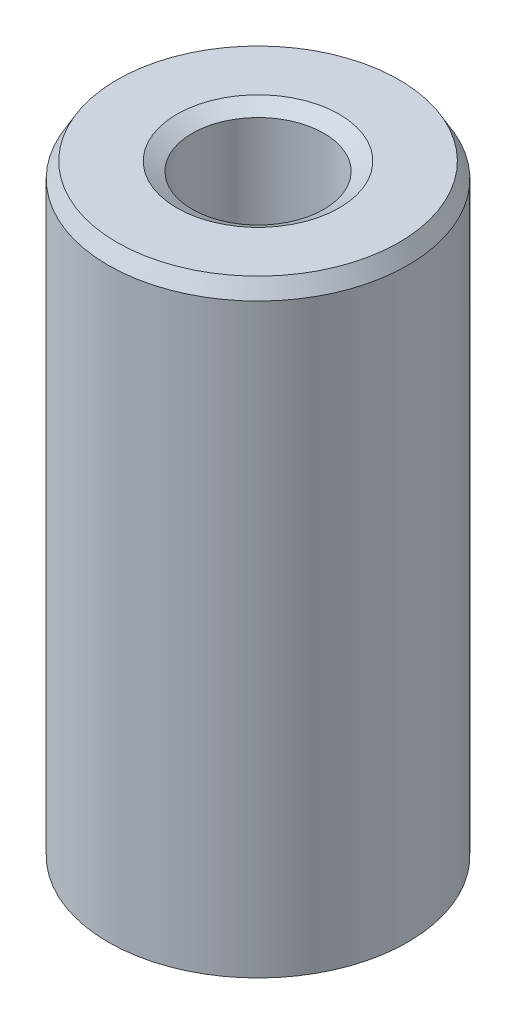
ISO-10303-21;
HEADER;
FILE_DESCRIPTION(('STEP AP214'),'2;1');
FILE_NAME('part.step','',(''),(''),'','','');
FILE_SCHEMA(('AUTOMOTIVE_DESIGN { 1 0 10303 214 1 1 1 1 }'));
ENDSEC;
DATA;
#1=APPLICATION_CONTEXT('core data for automotive mechanical design processes');
#2=APPLICATION_PROTOCOL_DEFINITION('international standard','automotive_design',2000,#1);
#3=PRODUCT_CONTEXT('',#1,'mechanical');
#4=PRODUCT('Part','Part','',(#3));
#5=PRODUCT_RELATED_PRODUCT_CATEGORY('part','',(#4));
#6=PRODUCT_DEFINITION_FORMATION('','',#4);
#7=PRODUCT_DEFINITION_CONTEXT('part definition',#1,'design');
#8=PRODUCT_DEFINITION('design','',#6,#7);
#9=PRODUCT_DEFINITION_SHAPE('','',#8);
#10=(LENGTH_UNIT() NAMED_UNIT(*) SI_UNIT(.MILLI.,.METRE.));
#11=(NAMED_UNIT(*) PLANE_ANGLE_UNIT() SI_UNIT($,.RADIAN.));
#12=(NAMED_UNIT(*) SI_UNIT($,.STERADIAN.) SOLID_ANGLE_UNIT());
#13=UNCERTAINTY_MEASURE_WITH_UNIT(LENGTH_MEASURE(1.E-05),#10,'distance_accuracy_value','');
#14=(GEOMETRIC_REPRESENTATION_CONTEXT(3) GLOBAL_UNCERTAINTY_ASSIGNED_CONTEXT((#13)) GLOBAL_UNIT_ASSIGNED_CONTEXT((#10,
#11,#12)) REPRESENTATION_CONTEXT('',''));
#15=CARTESIAN_POINT('',(0.,0.,0.));
#16=DIRECTION('',(0.,0.,1.));
#17=DIRECTION('',(1.,0.,0.));
#18=AXIS2_PLACEMENT_3D('',#15,#16,#17);
#19=CARTESIAN_POINT('',(0.,71.3074367263374,0.));
#20=DIRECTION('',(0.,-1.,0.));
#21=DIRECTION('',(0.,0.,-1.));
#22=AXIS2_PLACEMENT_3D('',#19,#20,#21);
#23=CYLINDRICAL_SURFACE('',#22,17.5);
#24=CARTESIAN_POINT('',(0.,1.03408028774482,0.));
#25=DIRECTION('',(0.,1.,0.));
#26=DIRECTION('',(0.,0.,1.));
#27=AXIS2_PLACEMENT_3D('',#24,#25,#26);
#28=CIRCLE('',#27,17.5);
#29=CARTESIAN_POINT('',(0.,1.03408028774482,17.5));
#30=VERTEX_POINT('',#29);
#31=EDGE_CURVE('E10',#30,#30,#28,.T.);
#32=ORIENTED_EDGE('',*,*,#31,.T.);
#33=EDGE_LOOP('',(#32));
#34=FACE_BOUND('',#33,.T.);
#35=CARTESIAN_POINT('',(0.,69.5163571288579,0.));
#36=DIRECTION('',(0.,1.,0.));
#37=DIRECTION('',(0.,0.,1.));
#38=AXIS2_PLACEMENT_3D('',#35,#36,#37);
#39=CIRCLE('',#38,17.5);
#40=CARTESIAN_POINT('',(0.,69.5163571288579,17.5));
#41=VERTEX_POINT('',#40);
#42=EDGE_CURVE('E50',#41,#41,#39,.F.);
#43=ORIENTED_EDGE('',*,*,#42,.T.);
#44=EDGE_LOOP('',(#43));
#45=FACE_BOUND('',#44,.T.);
#46=ADVANCED_FACE('F39',(#34,#45),#23,.T.);
#47=CARTESIAN_POINT('',(0.,71.3074367263374,0.));
#48=DIRECTION('',(0.,1.,0.));
#49=DIRECTION('',(0.,0.,1.));
#50=AXIS2_PLACEMENT_3D('',#47,#48,#49);
#51=PLANE('',#50);
#52=CARTESIAN_POINT('',(0.,71.3074367263374,0.));
#53=DIRECTION('',(0.,1.,0.));
#54=DIRECTION('',(0.,0.,1.));
#55=AXIS2_PLACEMENT_3D('',#52,#53,#54);
#56=CIRCLE('',#55,9.48671580728762);
#57=CARTESIAN_POINT('',(0.,71.3074367263374,9.48671580728762));
#58=VERTEX_POINT('',#57);
#59=EDGE_CURVE('E58',#58,#58,#56,.F.);
#60=ORIENTED_EDGE('',*,*,#59,.T.);
#61=EDGE_LOOP('',(#60));
#62=FACE_BOUND('',#61,.T.);
#63=CARTESIAN_POINT('',(0.,71.3074367263374,0.));
#64=DIRECTION('',(0.,1.,0.));
#65=DIRECTION('',(0.,0.,1.));
#66=AXIS2_PLACEMENT_3D('',#63,#64,#65);
#67=CIRCLE('',#66,16.4659197122552);
#68=CARTESIAN_POINT('',(0.,71.3074367263374,16.4659197122552));
#69=VERTEX_POINT('',#68);
#70=EDGE_CURVE('E61',#69,#69,#67,.T.);
#71=ORIENTED_EDGE('',*,*,#70,.T.);
#72=EDGE_LOOP('',(#71));
#73=FACE_BOUND('',#72,.T.);
#74=ADVANCED_FACE('F88',(#62,#73),#51,.T.);
#75=CARTESIAN_POINT('',(0.,0.,0.));
#76=DIRECTION('',(0.,1.,0.));
#77=DIRECTION('',(0.,0.,1.));
#78=AXIS2_PLACEMENT_3D('',#75,#76,#77);
#79=PLANE('',#78);
#80=CARTESIAN_POINT('',(0.,0.,0.));
#81=DIRECTION('',(0.,1.,0.));
#82=DIRECTION('',(0.,0.,1.));
#83=AXIS2_PLACEMENT_3D('',#80,#81,#82);
#84=CIRCLE('',#83,8.72971649755296);
#85=CARTESIAN_POINT('',(0.,0.,8.72971649755296));
#86=VERTEX_POINT('',#85);
#87=EDGE_CURVE('E51',#86,#86,#84,.T.);
#88=ORIENTED_EDGE('',*,*,#87,.T.);
#89=EDGE_LOOP('',(#88));
#90=FACE_BOUND('',#89,.T.);
#91=CARTESIAN_POINT('',(0.,0.,0.));
#92=DIRECTION('',(0.,1.,0.));
#93=DIRECTION('',(0.,0.,1.));
#94=AXIS2_PLACEMENT_3D('',#91,#92,#93);
#95=CIRCLE('',#94,15.7089204025205);
#96=CARTESIAN_POINT('',(0.,0.,15.7089204025205));
#97=VERTEX_POINT('',#96);
#98=EDGE_CURVE('E54',#97,#97,#95,.F.);
#99=ORIENTED_EDGE('',*,*,#98,.T.);
#100=EDGE_LOOP('',(#99));
#101=FACE_BOUND('',#100,.T.);
#102=ADVANCED_FACE('F83',(#90,#101),#79,.F.);
#103=CARTESIAN_POINT('',(0.,71.3074367263374,0.));
#104=DIRECTION('',(0.,-1.,0.));
#105=DIRECTION('',(0.,0.,-1.));
#106=AXIS2_PLACEMENT_3D('',#103,#104,#105);
#107=CYLINDRICAL_SURFACE('',#106,7.69563620980816);
#108=CARTESIAN_POINT('',(0.,70.2733564385926,0.));
#109=DIRECTION('',(0.,1.,0.));
#110=DIRECTION('',(0.,0.,1.));
#111=AXIS2_PLACEMENT_3D('',#108,#109,#110);
#112=CIRCLE('',#111,7.69563620980816);
#113=CARTESIAN_POINT('',(0.,70.2733564385926,7.69563620980816));
#114=VERTEX_POINT('',#113);
#115=EDGE_CURVE('E67',#114,#114,#112,.T.);
#116=ORIENTED_EDGE('',*,*,#115,.T.);
#117=EDGE_LOOP('',(#116));
#118=FACE_BOUND('',#117,.T.);
#119=CARTESIAN_POINT('',(0.,1.79107959747948,0.));
#120=DIRECTION('',(0.,1.,0.));
#121=DIRECTION('',(0.,0.,1.));
#122=AXIS2_PLACEMENT_3D('',#119,#120,#121);
#123=CIRCLE('',#122,7.69563620980816);
#124=CARTESIAN_POINT('',(0.,1.79107959747948,7.69563620980816));
#125=VERTEX_POINT('',#124);
#126=EDGE_CURVE('E69',#125,#125,#123,.F.);
#127=ORIENTED_EDGE('',*,*,#126,.T.);
#128=EDGE_LOOP('',(#127));
#129=FACE_BOUND('',#128,.T.);
#130=ADVANCED_FACE('F71',(#118,#129),#107,.F.);
#131=CARTESIAN_POINT('',(0.,70.2733564385926,0.));
#132=DIRECTION('',(0.,1.,0.));
#133=DIRECTION('',(0.,0.,1.));
#134=AXIS2_PLACEMENT_3D('',#131,#132,#133);
#135=CONICAL_SURFACE('',#134,7.69563620980816,1.0471975511966);
#136=ORIENTED_EDGE('',*,*,#59,.F.);
#137=EDGE_LOOP('',(#136));
#138=FACE_BOUND('',#137,.T.);
#139=ORIENTED_EDGE('',*,*,#115,.F.);
#140=EDGE_LOOP('',(#139));
#141=FACE_BOUND('',#140,.T.);
#142=ADVANCED_FACE('F77',(#138,#141),#135,.F.);
#143=CARTESIAN_POINT('',(0.,0.,0.));
#144=DIRECTION('',(0.,-1.,0.));
#145=DIRECTION('',(0.,0.,-1.));
#146=AXIS2_PLACEMENT_3D('',#143,#144,#145);
#147=CONICAL_SURFACE('',#146,8.72971649755296,0.52359877559829);
#148=ORIENTED_EDGE('',*,*,#126,.F.);
#149=EDGE_LOOP('',(#148));
#150=FACE_BOUND('',#149,.T.);
#151=ORIENTED_EDGE('',*,*,#87,.F.);
#152=EDGE_LOOP('',(#151));
#153=FACE_BOUND('',#152,.T.);
#154=ADVANCED_FACE('F73',(#150,#153),#147,.F.);
#155=CARTESIAN_POINT('',(0.,1.03408028774482,0.));
#156=DIRECTION('',(0.,1.,0.));
#157=DIRECTION('',(0.,0.,1.));
#158=AXIS2_PLACEMENT_3D('',#155,#156,#157);
#159=CONICAL_SURFACE('',#158,17.5,1.0471975511966);
#160=ORIENTED_EDGE('',*,*,#98,.F.);
#161=EDGE_LOOP('',(#160));
#162=FACE_BOUND('',#161,.T.);
#163=ORIENTED_EDGE('',*,*,#31,.F.);
#164=EDGE_LOOP('',(#163));
#165=FACE_BOUND('',#164,.T.);
#166=ADVANCED_FACE('F76',(#162,#165),#159,.T.);
#167=CARTESIAN_POINT('',(0.,71.3074367263374,0.));
#168=DIRECTION('',(0.,-1.,0.));
#169=DIRECTION('',(0.,0.,-1.));
#170=AXIS2_PLACEMENT_3D('',#167,#168,#169);
#171=CONICAL_SURFACE('',#170,16.4659197122552,0.523598775598295);
#172=ORIENTED_EDGE('',*,*,#42,.F.);
#173=EDGE_LOOP('',(#172));
#174=FACE_BOUND('',#173,.T.);
#175=ORIENTED_EDGE('',*,*,#70,.F.);
#176=EDGE_LOOP('',(#175));
#177=FACE_BOUND('',#176,.T.);
#178=ADVANCED_FACE('F45',(#174,#177),#171,.T.);
#179=CLOSED_SHELL('',(#46,#74,#102,#130,#142,#154,#166,#178));
#180=MANIFOLD_SOLID_BREP('B2',#179);
#181=ADVANCED_BREP_SHAPE_REPRESENTATION('',(#18,#180),#14);
#182=SHAPE_DEFINITION_REPRESENTATION(#9,#181);
ENDSEC;
END-ISO-10303-21;
